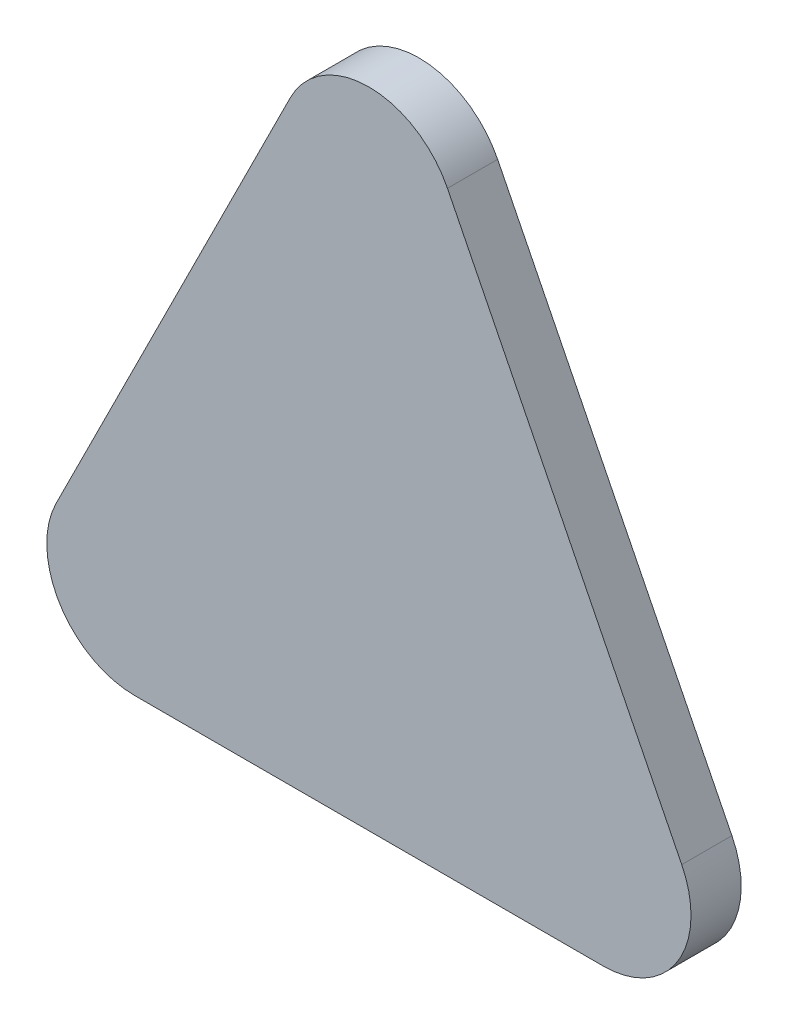
ISO-10303-21;
HEADER;
FILE_DESCRIPTION(('STEP AP214'),'2;1');
FILE_NAME('part.step','',(''),(''),'','','');
FILE_SCHEMA(('AUTOMOTIVE_DESIGN { 1 0 10303 214 1 1 1 1 }'));
ENDSEC;
DATA;
#1=APPLICATION_CONTEXT('core data for automotive mechanical design processes');
#2=APPLICATION_PROTOCOL_DEFINITION('international standard','automotive_design',2000,#1);
#3=PRODUCT_CONTEXT('',#1,'mechanical');
#4=PRODUCT('Part','Part','',(#3));
#5=PRODUCT_RELATED_PRODUCT_CATEGORY('part','',(#4));
#6=PRODUCT_DEFINITION_FORMATION('','',#4);
#7=PRODUCT_DEFINITION_CONTEXT('part definition',#1,'design');
#8=PRODUCT_DEFINITION('design','',#6,#7);
#9=PRODUCT_DEFINITION_SHAPE('','',#8);
#10=(LENGTH_UNIT() NAMED_UNIT(*) SI_UNIT(.MILLI.,.METRE.));
#11=(NAMED_UNIT(*) PLANE_ANGLE_UNIT() SI_UNIT($,.RADIAN.));
#12=(NAMED_UNIT(*) SI_UNIT($,.STERADIAN.) SOLID_ANGLE_UNIT());
#13=UNCERTAINTY_MEASURE_WITH_UNIT(LENGTH_MEASURE(1.E-05),#10,'distance_accuracy_value','');
#14=(GEOMETRIC_REPRESENTATION_CONTEXT(3) GLOBAL_UNCERTAINTY_ASSIGNED_CONTEXT((#13)) GLOBAL_UNIT_ASSIGNED_CONTEXT((#10,
#11,#12)) REPRESENTATION_CONTEXT('',''));
#15=CARTESIAN_POINT('',(0.,0.,0.));
#16=DIRECTION('',(0.,0.,1.));
#17=DIRECTION('',(1.,0.,0.));
#18=AXIS2_PLACEMENT_3D('',#15,#16,#17);
#19=CARTESIAN_POINT('',(-23.7156778400134,8.89,5.08));
#20=DIRECTION('',(0.,0.,-1.));
#21=DIRECTION('',(-1.,0.,0.));
#22=AXIS2_PLACEMENT_3D('',#19,#20,#21);
#23=CYLINDRICAL_SURFACE('',#22,8.89);
#24=CARTESIAN_POINT('',(-23.7156778400134,8.89,0.));
#25=DIRECTION('',(0.,0.,-1.));
#26=DIRECTION('',(-1.,0.,0.));
#27=AXIS2_PLACEMENT_3D('',#24,#25,#26);
#28=CIRCLE('',#27,8.89);
#29=CARTESIAN_POINT('',(-23.7156778400133,0.,0.));
#30=VERTEX_POINT('',#29);
#31=CARTESIAN_POINT('',(-31.6671355680026,12.8657288639947,0.));
#32=VERTEX_POINT('',#31);
#33=EDGE_CURVE('E135',#30,#32,#28,.T.);
#34=ORIENTED_EDGE('',*,*,#33,.F.);
#35=DIRECTION('',(0.,0.,-1.));
#36=VECTOR('',#35,1.);
#37=CARTESIAN_POINT('',(-23.7156778400133,0.,5.08));
#38=LINE('',#37,#36);
#39=CARTESIAN_POINT('',(-23.7156778400133,0.,5.08));
#40=VERTEX_POINT('',#39);
#41=EDGE_CURVE('E11',#40,#30,#38,.T.);
#42=ORIENTED_EDGE('',*,*,#41,.F.);
#43=CARTESIAN_POINT('',(-23.7156778400134,8.89,5.08));
#44=DIRECTION('',(0.,0.,-1.));
#45=DIRECTION('',(-1.,0.,0.));
#46=AXIS2_PLACEMENT_3D('',#43,#44,#45);
#47=CIRCLE('',#46,8.89);
#48=CARTESIAN_POINT('',(-31.6671355680026,12.8657288639947,5.08));
#49=VERTEX_POINT('',#48);
#50=EDGE_CURVE('E155',#40,#49,#47,.T.);
#51=ORIENTED_EDGE('',*,*,#50,.T.);
#52=DIRECTION('',(0.,0.,-1.));
#53=VECTOR('',#52,1.);
#54=CARTESIAN_POINT('',(-31.6671355680026,12.8657288639947,5.08));
#55=LINE('',#54,#53);
#56=EDGE_CURVE('E48',#49,#32,#55,.T.);
#57=ORIENTED_EDGE('',*,*,#56,.T.);
#58=EDGE_LOOP('',(#34,#42,#51,#57));
#59=FACE_BOUND('',#58,.T.);
#60=ADVANCED_FACE('F45',(#59),#23,.T.);
#61=CARTESIAN_POINT('',(23.7156778400133,0.,5.08));
#62=DIRECTION('',(0.,-1.,0.));
#63=DIRECTION('',(1.,0.,0.));
#64=AXIS2_PLACEMENT_3D('',#61,#62,#63);
#65=PLANE('',#64);
#66=DIRECTION('',(-1.,0.,0.));
#67=VECTOR('',#66,1.);
#68=CARTESIAN_POINT('',(23.7156778400133,0.,0.));
#69=LINE('',#68,#67);
#70=CARTESIAN_POINT('',(23.7156778400133,0.,0.));
#71=VERTEX_POINT('',#70);
#72=EDGE_CURVE('E152',#71,#30,#69,.T.);
#73=ORIENTED_EDGE('',*,*,#72,.F.);
#74=DIRECTION('',(0.,0.,-1.));
#75=VECTOR('',#74,1.);
#76=CARTESIAN_POINT('',(23.7156778400133,0.,5.08));
#77=LINE('',#76,#75);
#78=CARTESIAN_POINT('',(23.7156778400133,0.,5.08));
#79=VERTEX_POINT('',#78);
#80=EDGE_CURVE('E55',#79,#71,#77,.T.);
#81=ORIENTED_EDGE('',*,*,#80,.F.);
#82=DIRECTION('',(-1.,0.,0.));
#83=VECTOR('',#82,1.);
#84=CARTESIAN_POINT('',(23.7156778400133,0.,5.08));
#85=LINE('',#84,#83);
#86=EDGE_CURVE('E120',#79,#40,#85,.T.);
#87=ORIENTED_EDGE('',*,*,#86,.T.);
#88=ORIENTED_EDGE('',*,*,#41,.T.);
#89=EDGE_LOOP('',(#73,#81,#87,#88));
#90=FACE_BOUND('',#89,.T.);
#91=ADVANCED_FACE('F168',(#90),#65,.T.);
#92=CARTESIAN_POINT('',(23.7156778400134,8.88999999999999,5.08));
#93=DIRECTION('',(0.,0.,-1.));
#94=DIRECTION('',(-1.,0.,0.));
#95=AXIS2_PLACEMENT_3D('',#92,#93,#94);
#96=CYLINDRICAL_SURFACE('',#95,8.89);
#97=CARTESIAN_POINT('',(23.7156778400134,8.88999999999999,0.));
#98=DIRECTION('',(0.,0.,-1.));
#99=DIRECTION('',(-1.,0.,0.));
#100=AXIS2_PLACEMENT_3D('',#97,#98,#99);
#101=CIRCLE('',#100,8.89);
#102=CARTESIAN_POINT('',(31.6671355680026,12.8657288639947,0.));
#103=VERTEX_POINT('',#102);
#104=EDGE_CURVE('E108',#103,#71,#101,.T.);
#105=ORIENTED_EDGE('',*,*,#104,.F.);
#106=DIRECTION('',(0.,0.,-1.));
#107=VECTOR('',#106,1.);
#108=CARTESIAN_POINT('',(31.6671355680026,12.8657288639947,5.08));
#109=LINE('',#108,#107);
#110=CARTESIAN_POINT('',(31.6671355680026,12.8657288639947,5.08));
#111=VERTEX_POINT('',#110);
#112=EDGE_CURVE('E103',#111,#103,#109,.T.);
#113=ORIENTED_EDGE('',*,*,#112,.F.);
#114=CARTESIAN_POINT('',(23.7156778400134,8.88999999999999,5.08));
#115=DIRECTION('',(0.,0.,-1.));
#116=DIRECTION('',(-1.,0.,0.));
#117=AXIS2_PLACEMENT_3D('',#114,#115,#116);
#118=CIRCLE('',#117,8.89);
#119=EDGE_CURVE('E106',#111,#79,#118,.T.);
#120=ORIENTED_EDGE('',*,*,#119,.T.);
#121=ORIENTED_EDGE('',*,*,#80,.T.);
#122=EDGE_LOOP('',(#105,#113,#120,#121));
#123=FACE_BOUND('',#122,.T.);
#124=ADVANCED_FACE('F105',(#123),#96,.T.);
#125=CARTESIAN_POINT('',(7.95145772798932,60.2970845440214,5.08));
#126=DIRECTION('',(0.894427190999916,0.447213595499958,0.));
#127=DIRECTION('',(-0.447213595499958,0.894427190999916,0.));
#128=AXIS2_PLACEMENT_3D('',#125,#126,#127);
#129=PLANE('',#128);
#130=DIRECTION('',(0.447213595499958,-0.894427190999916,0.));
#131=VECTOR('',#130,1.);
#132=CARTESIAN_POINT('',(7.95145772798932,60.2970845440214,0.));
#133=LINE('',#132,#131);
#134=CARTESIAN_POINT('',(7.95145772798932,60.2970845440214,0.));
#135=VERTEX_POINT('',#134);
#136=EDGE_CURVE('E147',#135,#103,#133,.T.);
#137=ORIENTED_EDGE('',*,*,#136,.F.);
#138=DIRECTION('',(0.,0.,-1.));
#139=VECTOR('',#138,1.);
#140=CARTESIAN_POINT('',(7.95145772798932,60.2970845440214,5.08));
#141=LINE('',#140,#139);
#142=CARTESIAN_POINT('',(7.95145772798932,60.2970845440214,5.08));
#143=VERTEX_POINT('',#142);
#144=EDGE_CURVE('E114',#143,#135,#141,.T.);
#145=ORIENTED_EDGE('',*,*,#144,.F.);
#146=DIRECTION('',(0.447213595499958,-0.894427190999916,0.));
#147=VECTOR('',#146,1.);
#148=CARTESIAN_POINT('',(7.95145772798932,60.2970845440214,5.08));
#149=LINE('',#148,#147);
#150=EDGE_CURVE('E119',#143,#111,#149,.T.);
#151=ORIENTED_EDGE('',*,*,#150,.T.);
#152=ORIENTED_EDGE('',*,*,#112,.T.);
#153=EDGE_LOOP('',(#137,#145,#151,#152));
#154=FACE_BOUND('',#153,.T.);
#155=ADVANCED_FACE('F123',(#154),#129,.T.);
#156=CARTESIAN_POINT('',(0.,56.3213556800269,5.08));
#157=DIRECTION('',(0.,0.,-1.));
#158=DIRECTION('',(-1.,0.,0.));
#159=AXIS2_PLACEMENT_3D('',#156,#157,#158);
#160=CYLINDRICAL_SURFACE('',#159,8.89);
#161=CARTESIAN_POINT('',(0.,56.3213556800269,0.));
#162=DIRECTION('',(0.,0.,1.));
#163=DIRECTION('',(1.,0.,0.));
#164=AXIS2_PLACEMENT_3D('',#161,#162,#163);
#165=CIRCLE('',#164,8.89);
#166=CARTESIAN_POINT('',(-7.95145772798932,60.2970845440214,0.));
#167=VERTEX_POINT('',#166);
#168=EDGE_CURVE('E143',#135,#167,#165,.T.);
#169=ORIENTED_EDGE('',*,*,#168,.T.);
#170=DIRECTION('',(0.,0.,-1.));
#171=VECTOR('',#170,1.);
#172=CARTESIAN_POINT('',(-7.95145772798932,60.2970845440214,5.08));
#173=LINE('',#172,#171);
#174=CARTESIAN_POINT('',(-7.95145772798932,60.2970845440214,5.08));
#175=VERTEX_POINT('',#174);
#176=EDGE_CURVE('E160',#175,#167,#173,.T.);
#177=ORIENTED_EDGE('',*,*,#176,.F.);
#178=CARTESIAN_POINT('',(0.,56.3213556800269,5.08));
#179=DIRECTION('',(0.,0.,1.));
#180=DIRECTION('',(1.,0.,0.));
#181=AXIS2_PLACEMENT_3D('',#178,#179,#180);
#182=CIRCLE('',#181,8.89);
#183=EDGE_CURVE('E126',#143,#175,#182,.T.);
#184=ORIENTED_EDGE('',*,*,#183,.F.);
#185=ORIENTED_EDGE('',*,*,#144,.T.);
#186=EDGE_LOOP('',(#169,#177,#184,#185));
#187=FACE_BOUND('',#186,.T.);
#188=ADVANCED_FACE('F181',(#187),#160,.T.);
#189=CARTESIAN_POINT('',(-31.6671355680026,12.8657288639947,5.08));
#190=DIRECTION('',(-0.894427190999916,0.447213595499958,0.));
#191=DIRECTION('',(-0.447213595499958,-0.894427190999916,0.));
#192=AXIS2_PLACEMENT_3D('',#189,#190,#191);
#193=PLANE('',#192);
#194=DIRECTION('',(0.447213595499958,0.894427190999916,0.));
#195=VECTOR('',#194,1.);
#196=CARTESIAN_POINT('',(-31.6671355680026,12.8657288639947,0.));
#197=LINE('',#196,#195);
#198=EDGE_CURVE('E139',#32,#167,#197,.T.);
#199=ORIENTED_EDGE('',*,*,#198,.F.);
#200=ORIENTED_EDGE('',*,*,#56,.F.);
#201=DIRECTION('',(0.447213595499958,0.894427190999916,0.));
#202=VECTOR('',#201,1.);
#203=CARTESIAN_POINT('',(-31.6671355680026,12.8657288639947,5.08));
#204=LINE('',#203,#202);
#205=EDGE_CURVE('E129',#49,#175,#204,.T.);
#206=ORIENTED_EDGE('',*,*,#205,.T.);
#207=ORIENTED_EDGE('',*,*,#176,.T.);
#208=EDGE_LOOP('',(#199,#200,#206,#207));
#209=FACE_BOUND('',#208,.T.);
#210=ADVANCED_FACE('F164',(#209),#193,.T.);
#211=CARTESIAN_POINT('',(-23.7156778400134,8.89,5.08));
#212=DIRECTION('',(0.,0.,-1.));
#213=DIRECTION('',(-1.,0.,0.));
#214=AXIS2_PLACEMENT_3D('',#211,#212,#213);
#215=PLANE('',#214);
#216=ORIENTED_EDGE('',*,*,#50,.F.);
#217=ORIENTED_EDGE('',*,*,#86,.F.);
#218=ORIENTED_EDGE('',*,*,#119,.F.);
#219=ORIENTED_EDGE('',*,*,#150,.F.);
#220=ORIENTED_EDGE('',*,*,#183,.T.);
#221=ORIENTED_EDGE('',*,*,#205,.F.);
#222=EDGE_LOOP('',(#216,#217,#218,#219,#220,#221));
#223=FACE_BOUND('',#222,.T.);
#224=ADVANCED_FACE('F118',(#223),#215,.F.);
#225=CARTESIAN_POINT('',(-23.7156778400134,8.89,0.));
#226=DIRECTION('',(0.,0.,-1.));
#227=DIRECTION('',(-1.,0.,0.));
#228=AXIS2_PLACEMENT_3D('',#225,#226,#227);
#229=PLANE('',#228);
#230=ORIENTED_EDGE('',*,*,#33,.T.);
#231=ORIENTED_EDGE('',*,*,#198,.T.);
#232=ORIENTED_EDGE('',*,*,#168,.F.);
#233=ORIENTED_EDGE('',*,*,#136,.T.);
#234=ORIENTED_EDGE('',*,*,#104,.T.);
#235=ORIENTED_EDGE('',*,*,#72,.T.);
#236=EDGE_LOOP('',(#230,#231,#232,#233,#234,#235));
#237=FACE_BOUND('',#236,.T.);
#238=ADVANCED_FACE('F167',(#237),#229,.T.);
#239=CLOSED_SHELL('',(#60,#91,#124,#155,#188,#210,#224,#238));
#240=MANIFOLD_SOLID_BREP('B2',#239);
#241=ADVANCED_BREP_SHAPE_REPRESENTATION('',(#18,#240),#14);
#242=SHAPE_DEFINITION_REPRESENTATION(#9,#241);
ENDSEC;
END-ISO-10303-21;
